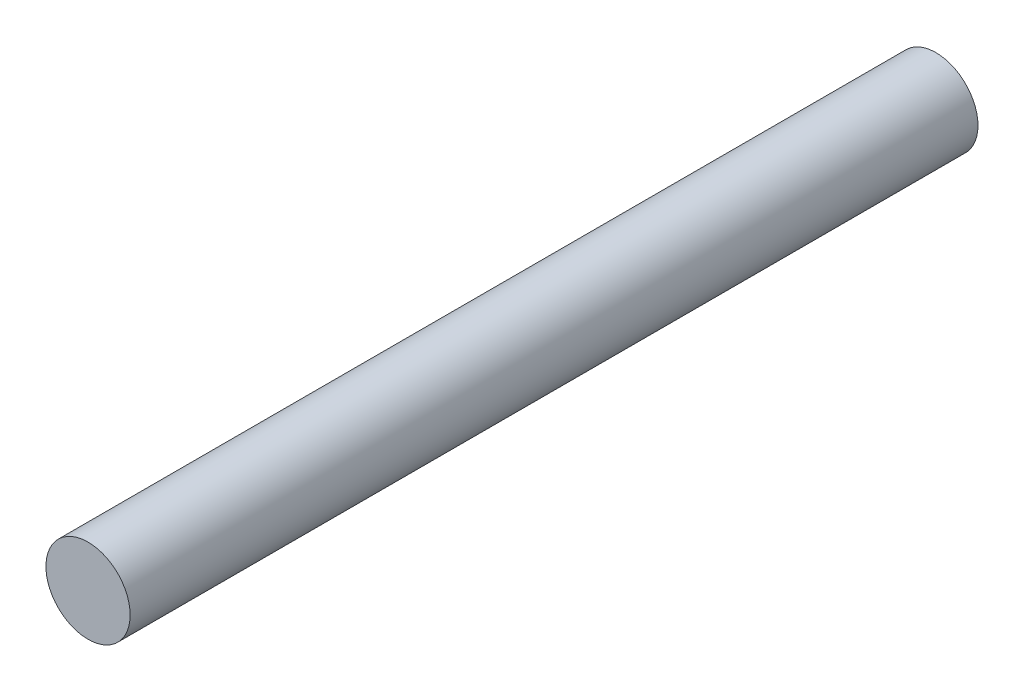
ISO-10303-21;
HEADER;
FILE_DESCRIPTION(('STEP AP214'),'2;1');
FILE_NAME('part.step','',(''),(''),'','','');
FILE_SCHEMA(('AUTOMOTIVE_DESIGN { 1 0 10303 214 1 1 1 1 }'));
ENDSEC;
DATA;
#1=APPLICATION_CONTEXT('core data for automotive mechanical design processes');
#2=APPLICATION_PROTOCOL_DEFINITION('international standard','automotive_design',2000,#1);
#3=PRODUCT_CONTEXT('',#1,'mechanical');
#4=PRODUCT('Part','Part','',(#3));
#5=PRODUCT_RELATED_PRODUCT_CATEGORY('part','',(#4));
#6=PRODUCT_DEFINITION_FORMATION('','',#4);
#7=PRODUCT_DEFINITION_CONTEXT('part definition',#1,'design');
#8=PRODUCT_DEFINITION('design','',#6,#7);
#9=PRODUCT_DEFINITION_SHAPE('','',#8);
#10=(LENGTH_UNIT() NAMED_UNIT(*) SI_UNIT(.MILLI.,.METRE.));
#11=(NAMED_UNIT(*) PLANE_ANGLE_UNIT() SI_UNIT($,.RADIAN.));
#12=(NAMED_UNIT(*) SI_UNIT($,.STERADIAN.) SOLID_ANGLE_UNIT());
#13=UNCERTAINTY_MEASURE_WITH_UNIT(LENGTH_MEASURE(1.E-05),#10,'distance_accuracy_value','');
#14=(GEOMETRIC_REPRESENTATION_CONTEXT(3) GLOBAL_UNCERTAINTY_ASSIGNED_CONTEXT((#13)) GLOBAL_UNIT_ASSIGNED_CONTEXT((#10,
#11,#12)) REPRESENTATION_CONTEXT('',''));
#15=CARTESIAN_POINT('',(0.,0.,0.));
#16=DIRECTION('',(0.,0.,1.));
#17=DIRECTION('',(1.,0.,0.));
#18=AXIS2_PLACEMENT_3D('',#15,#16,#17);
#19=CARTESIAN_POINT('',(0.,0.,75.));
#20=DIRECTION('',(0.,0.,-1.));
#21=DIRECTION('',(-1.,0.,0.));
#22=AXIS2_PLACEMENT_3D('',#19,#20,#21);
#23=CYLINDRICAL_SURFACE('',#22,3.725);
#24=CARTESIAN_POINT('',(0.,0.,75.));
#25=DIRECTION('',(0.,0.,1.));
#26=DIRECTION('',(1.,0.,0.));
#27=AXIS2_PLACEMENT_3D('',#24,#25,#26);
#28=CIRCLE('',#27,3.725);
#29=CARTESIAN_POINT('',(3.725,0.,75.));
#30=VERTEX_POINT('',#29);
#31=EDGE_CURVE('E10',#30,#30,#28,.T.);
#32=ORIENTED_EDGE('',*,*,#31,.F.);
#33=EDGE_LOOP('',(#32));
#34=FACE_BOUND('',#33,.T.);
#35=CARTESIAN_POINT('',(0.,0.,0.));
#36=DIRECTION('',(0.,0.,1.));
#37=DIRECTION('',(1.,0.,0.));
#38=AXIS2_PLACEMENT_3D('',#35,#36,#37);
#39=CIRCLE('',#38,3.725);
#40=CARTESIAN_POINT('',(3.725,0.,0.));
#41=VERTEX_POINT('',#40);
#42=EDGE_CURVE('E37',#41,#41,#39,.T.);
#43=ORIENTED_EDGE('',*,*,#42,.T.);
#44=EDGE_LOOP('',(#43));
#45=FACE_BOUND('',#44,.T.);
#46=ADVANCED_FACE('F34',(#34,#45),#23,.T.);
#47=CARTESIAN_POINT('',(0.,0.,75.));
#48=DIRECTION('',(0.,0.,1.));
#49=DIRECTION('',(1.,0.,0.));
#50=AXIS2_PLACEMENT_3D('',#47,#48,#49);
#51=PLANE('',#50);
#52=ORIENTED_EDGE('',*,*,#31,.T.);
#53=EDGE_LOOP('',(#52));
#54=FACE_BOUND('',#53,.T.);
#55=ADVANCED_FACE('F53',(#54),#51,.T.);
#56=CARTESIAN_POINT('',(0.,0.,0.));
#57=DIRECTION('',(0.,0.,1.));
#58=DIRECTION('',(1.,0.,0.));
#59=AXIS2_PLACEMENT_3D('',#56,#57,#58);
#60=PLANE('',#59);
#61=ORIENTED_EDGE('',*,*,#42,.F.);
#62=EDGE_LOOP('',(#61));
#63=FACE_BOUND('',#62,.T.);
#64=ADVANCED_FACE('F51',(#63),#60,.F.);
#65=CLOSED_SHELL('',(#46,#55,#64));
#66=MANIFOLD_SOLID_BREP('B2',#65);
#67=ADVANCED_BREP_SHAPE_REPRESENTATION('',(#18,#66),#14);
#68=SHAPE_DEFINITION_REPRESENTATION(#9,#67);
ENDSEC;
END-ISO-10303-21;
